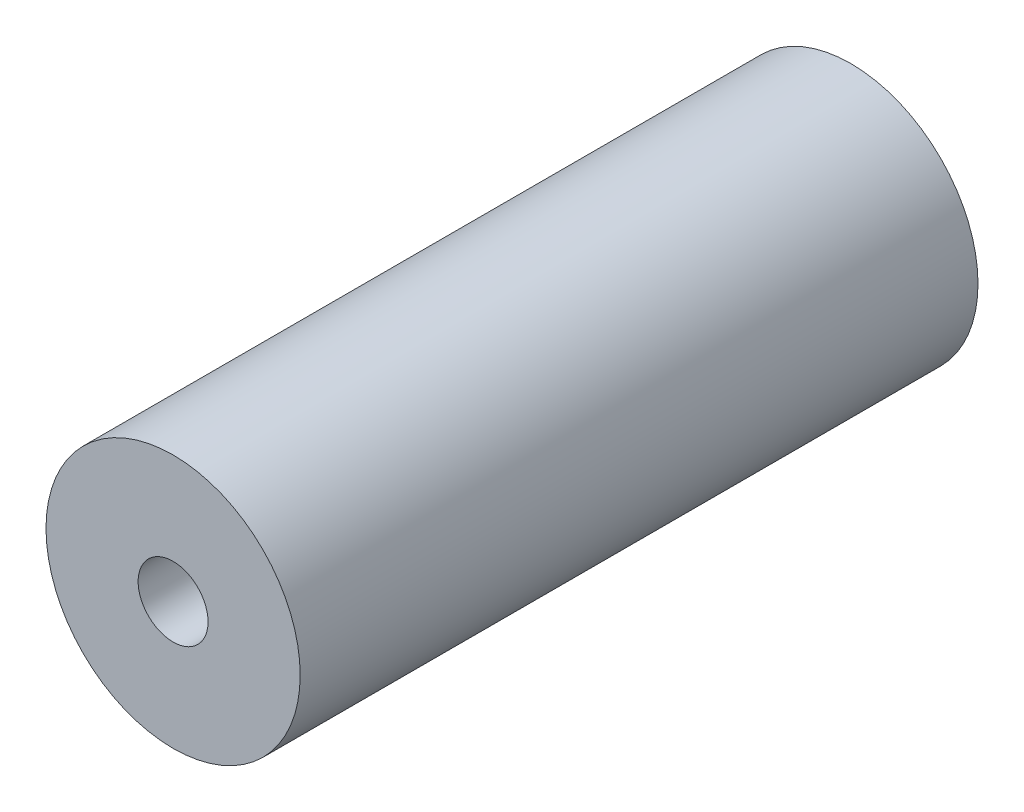
ISO-10303-21;
HEADER;
FILE_DESCRIPTION(('STEP AP214'),'2;1');
FILE_NAME('part.step','',(''),(''),'','','');
FILE_SCHEMA(('AUTOMOTIVE_DESIGN { 1 0 10303 214 1 1 1 1 }'));
ENDSEC;
DATA;
#1=APPLICATION_CONTEXT('core data for automotive mechanical design processes');
#2=APPLICATION_PROTOCOL_DEFINITION('international standard','automotive_design',2000,#1);
#3=PRODUCT_CONTEXT('',#1,'mechanical');
#4=PRODUCT('Part','Part','',(#3));
#5=PRODUCT_RELATED_PRODUCT_CATEGORY('part','',(#4));
#6=PRODUCT_DEFINITION_FORMATION('','',#4);
#7=PRODUCT_DEFINITION_CONTEXT('part definition',#1,'design');
#8=PRODUCT_DEFINITION('design','',#6,#7);
#9=PRODUCT_DEFINITION_SHAPE('','',#8);
#10=(LENGTH_UNIT() NAMED_UNIT(*) SI_UNIT(.MILLI.,.METRE.));
#11=(NAMED_UNIT(*) PLANE_ANGLE_UNIT() SI_UNIT($,.RADIAN.));
#12=(NAMED_UNIT(*) SI_UNIT($,.STERADIAN.) SOLID_ANGLE_UNIT());
#13=UNCERTAINTY_MEASURE_WITH_UNIT(LENGTH_MEASURE(1.E-05),#10,'distance_accuracy_value','');
#14=(GEOMETRIC_REPRESENTATION_CONTEXT(3) GLOBAL_UNCERTAINTY_ASSIGNED_CONTEXT((#13)) GLOBAL_UNIT_ASSIGNED_CONTEXT((#10,
#11,#12)) REPRESENTATION_CONTEXT('',''));
#15=CARTESIAN_POINT('',(0.,0.,0.));
#16=DIRECTION('',(0.,0.,1.));
#17=DIRECTION('',(1.,0.,0.));
#18=AXIS2_PLACEMENT_3D('',#15,#16,#17);
#19=CARTESIAN_POINT('',(0.,0.,16.));
#20=DIRECTION('',(0.,0.,-1.));
#21=DIRECTION('',(-1.,0.,0.));
#22=AXIS2_PLACEMENT_3D('',#19,#20,#21);
#23=CYLINDRICAL_SURFACE('',#22,6.);
#24=CARTESIAN_POINT('',(0.,0.,16.));
#25=DIRECTION('',(0.,0.,1.));
#26=DIRECTION('',(1.,0.,0.));
#27=AXIS2_PLACEMENT_3D('',#24,#25,#26);
#28=CIRCLE('',#27,6.);
#29=CARTESIAN_POINT('',(6.,0.,16.));
#30=VERTEX_POINT('',#29);
#31=EDGE_CURVE('E11',#30,#30,#28,.T.);
#32=ORIENTED_EDGE('',*,*,#31,.F.);
#33=EDGE_LOOP('',(#32));
#34=FACE_BOUND('',#33,.T.);
#35=CARTESIAN_POINT('',(0.,0.,-16.));
#36=DIRECTION('',(0.,0.,1.));
#37=DIRECTION('',(1.,0.,0.));
#38=AXIS2_PLACEMENT_3D('',#35,#36,#37);
#39=CIRCLE('',#38,6.);
#40=CARTESIAN_POINT('',(6.,0.,-16.));
#41=VERTEX_POINT('',#40);
#42=EDGE_CURVE('E40',#41,#41,#39,.T.);
#43=ORIENTED_EDGE('',*,*,#42,.T.);
#44=EDGE_LOOP('',(#43));
#45=FACE_BOUND('',#44,.T.);
#46=ADVANCED_FACE('F37',(#34,#45),#23,.T.);
#47=CARTESIAN_POINT('',(0.,0.,16.));
#48=DIRECTION('',(0.,0.,1.));
#49=DIRECTION('',(1.,0.,0.));
#50=AXIS2_PLACEMENT_3D('',#47,#48,#49);
#51=PLANE('',#50);
#52=CARTESIAN_POINT('',(0.,0.,16.));
#53=DIRECTION('',(0.,0.,1.));
#54=DIRECTION('',(1.,0.,0.));
#55=AXIS2_PLACEMENT_3D('',#52,#53,#54);
#56=CIRCLE('',#55,1.64999999999999);
#57=CARTESIAN_POINT('',(1.64999999999999,0.,16.));
#58=VERTEX_POINT('',#57);
#59=EDGE_CURVE('E60',#58,#58,#56,.T.);
#60=ORIENTED_EDGE('',*,*,#59,.F.);
#61=EDGE_LOOP('',(#60));
#62=FACE_BOUND('',#61,.T.);
#63=ORIENTED_EDGE('',*,*,#31,.T.);
#64=EDGE_LOOP('',(#63));
#65=FACE_BOUND('',#64,.T.);
#66=ADVANCED_FACE('F79',(#62,#65),#51,.T.);
#67=CARTESIAN_POINT('',(0.,0.,-16.));
#68=DIRECTION('',(0.,0.,1.));
#69=DIRECTION('',(1.,0.,0.));
#70=AXIS2_PLACEMENT_3D('',#67,#68,#69);
#71=PLANE('',#70);
#72=CARTESIAN_POINT('',(0.,0.,-16.));
#73=DIRECTION('',(0.,0.,-1.));
#74=DIRECTION('',(-1.,0.,0.));
#75=AXIS2_PLACEMENT_3D('',#72,#73,#74);
#76=CIRCLE('',#75,1.64999999999999);
#77=CARTESIAN_POINT('',(-1.64999999999999,0.,-16.));
#78=VERTEX_POINT('',#77);
#79=EDGE_CURVE('E61',#78,#78,#76,.T.);
#80=ORIENTED_EDGE('',*,*,#79,.F.);
#81=EDGE_LOOP('',(#80));
#82=FACE_BOUND('',#81,.T.);
#83=ORIENTED_EDGE('',*,*,#42,.F.);
#84=EDGE_LOOP('',(#83));
#85=FACE_BOUND('',#84,.T.);
#86=ADVANCED_FACE('F76',(#82,#85),#71,.F.);
#87=CARTESIAN_POINT('',(0.,0.,4.5));
#88=DIRECTION('',(0.,0.,1.));
#89=DIRECTION('',(1.,0.,0.));
#90=AXIS2_PLACEMENT_3D('',#87,#88,#89);
#91=CONICAL_SURFACE('',#90,1.64999999999999,1.02974425867665);
#92=CARTESIAN_POINT('',(0.,0.,3.50857997860453));
#93=VERTEX_POINT('',#92);
#94=VERTEX_LOOP('',#93);
#95=FACE_BOUND('',#94,.T.);
#96=CARTESIAN_POINT('',(0.,0.,4.5));
#97=DIRECTION('',(0.,0.,1.));
#98=DIRECTION('',(1.,0.,0.));
#99=AXIS2_PLACEMENT_3D('',#96,#97,#98);
#100=CIRCLE('',#99,1.64999999999999);
#101=CARTESIAN_POINT('',(1.64999999999999,0.,4.5));
#102=VERTEX_POINT('',#101);
#103=EDGE_CURVE('E64',#102,#102,#100,.T.);
#104=ORIENTED_EDGE('',*,*,#103,.T.);
#105=EDGE_LOOP('',(#104));
#106=FACE_BOUND('',#105,.T.);
#107=ADVANCED_FACE('F78',(#95,#106),#91,.F.);
#108=CARTESIAN_POINT('',(0.,0.,16.));
#109=DIRECTION('',(0.,0.,1.));
#110=DIRECTION('',(1.,0.,0.));
#111=AXIS2_PLACEMENT_3D('',#108,#109,#110);
#112=CYLINDRICAL_SURFACE('',#111,1.64999999999999);
#113=ORIENTED_EDGE('',*,*,#103,.F.);
#114=EDGE_LOOP('',(#113));
#115=FACE_BOUND('',#114,.T.);
#116=ORIENTED_EDGE('',*,*,#59,.T.);
#117=EDGE_LOOP('',(#116));
#118=FACE_BOUND('',#117,.T.);
#119=ADVANCED_FACE('F54',(#115,#118),#112,.F.);
#120=CARTESIAN_POINT('',(0.,0.,-4.5));
#121=DIRECTION('',(0.,0.,-1.));
#122=DIRECTION('',(-1.,0.,0.));
#123=AXIS2_PLACEMENT_3D('',#120,#121,#122);
#124=CONICAL_SURFACE('',#123,1.64999999999999,1.02974425867665);
#125=CARTESIAN_POINT('',(0.,0.,-3.50857997860453));
#126=VERTEX_POINT('',#125);
#127=VERTEX_LOOP('',#126);
#128=FACE_BOUND('',#127,.T.);
#129=CARTESIAN_POINT('',(0.,0.,-4.5));
#130=DIRECTION('',(0.,0.,-1.));
#131=DIRECTION('',(-1.,0.,0.));
#132=AXIS2_PLACEMENT_3D('',#129,#130,#131);
#133=CIRCLE('',#132,1.64999999999999);
#134=CARTESIAN_POINT('',(-1.64999999999999,0.,-4.5));
#135=VERTEX_POINT('',#134);
#136=EDGE_CURVE('E58',#135,#135,#133,.T.);
#137=ORIENTED_EDGE('',*,*,#136,.T.);
#138=EDGE_LOOP('',(#137));
#139=FACE_BOUND('',#138,.T.);
#140=ADVANCED_FACE('F50',(#128,#139),#124,.F.);
#141=CARTESIAN_POINT('',(0.,0.,-16.));
#142=DIRECTION('',(0.,0.,-1.));
#143=DIRECTION('',(-1.,0.,0.));
#144=AXIS2_PLACEMENT_3D('',#141,#142,#143);
#145=CYLINDRICAL_SURFACE('',#144,1.64999999999999);
#146=ORIENTED_EDGE('',*,*,#136,.F.);
#147=EDGE_LOOP('',(#146));
#148=FACE_BOUND('',#147,.T.);
#149=ORIENTED_EDGE('',*,*,#79,.T.);
#150=EDGE_LOOP('',(#149));
#151=FACE_BOUND('',#150,.T.);
#152=ADVANCED_FACE('F53',(#148,#151),#145,.F.);
#153=CLOSED_SHELL('',(#46,#66,#86,#107,#119,#140,#152));
#154=MANIFOLD_SOLID_BREP('B2',#153);
#155=ADVANCED_BREP_SHAPE_REPRESENTATION('',(#18,#154),#14);
#156=SHAPE_DEFINITION_REPRESENTATION(#9,#155);
ENDSEC;
END-ISO-10303-21;
